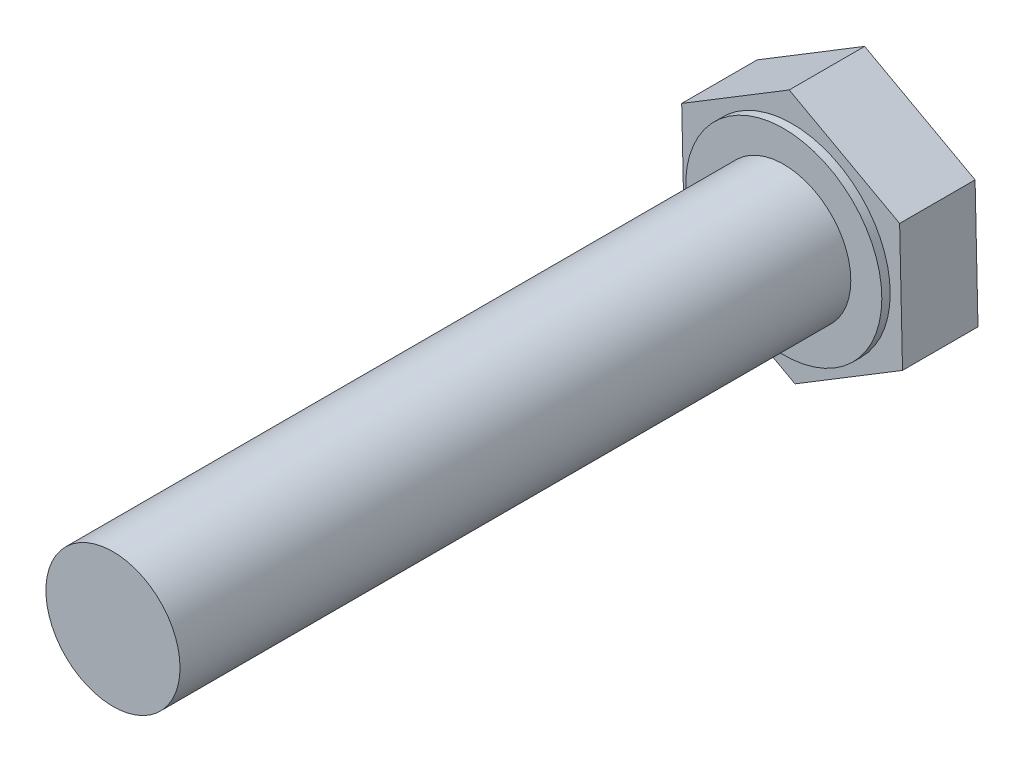
ISO-10303-21;
HEADER;
FILE_DESCRIPTION(('STEP AP214'),'2;1');
FILE_NAME('part.step','',(''),(''),'','','');
FILE_SCHEMA(('AUTOMOTIVE_DESIGN { 1 0 10303 214 1 1 1 1 }'));
ENDSEC;
DATA;
#1=APPLICATION_CONTEXT('core data for automotive mechanical design processes');
#2=APPLICATION_PROTOCOL_DEFINITION('international standard','automotive_design',2000,#1);
#3=PRODUCT_CONTEXT('',#1,'mechanical');
#4=PRODUCT('Part','Part','',(#3));
#5=PRODUCT_RELATED_PRODUCT_CATEGORY('part','',(#4));
#6=PRODUCT_DEFINITION_FORMATION('','',#4);
#7=PRODUCT_DEFINITION_CONTEXT('part definition',#1,'design');
#8=PRODUCT_DEFINITION('design','',#6,#7);
#9=PRODUCT_DEFINITION_SHAPE('','',#8);
#10=(LENGTH_UNIT() NAMED_UNIT(*) SI_UNIT(.MILLI.,.METRE.));
#11=(NAMED_UNIT(*) PLANE_ANGLE_UNIT() SI_UNIT($,.RADIAN.));
#12=(NAMED_UNIT(*) SI_UNIT($,.STERADIAN.) SOLID_ANGLE_UNIT());
#13=UNCERTAINTY_MEASURE_WITH_UNIT(LENGTH_MEASURE(1.E-05),#10,'distance_accuracy_value','');
#14=(GEOMETRIC_REPRESENTATION_CONTEXT(3) GLOBAL_UNCERTAINTY_ASSIGNED_CONTEXT((#13)) GLOBAL_UNIT_ASSIGNED_CONTEXT((#10,
#11,#12)) REPRESENTATION_CONTEXT('',''));
#15=CARTESIAN_POINT('',(0.,0.,0.));
#16=DIRECTION('',(0.,0.,1.));
#17=DIRECTION('',(1.,0.,0.));
#18=AXIS2_PLACEMENT_3D('',#15,#16,#17);
#19=CARTESIAN_POINT('',(-6.58498311375205,3.60157336797873,4.5));
#20=DIRECTION('',(0.999732976991626,0.0231078929255952,0.));
#21=DIRECTION('',(-0.0231078929255952,0.999732976991626,0.));
#22=AXIS2_PLACEMENT_3D('',#19,#20,#21);
#23=PLANE('',#22);
#24=DIRECTION('',(0.0231078929255952,-0.999732976991626,0.));
#25=VECTOR('',#24,1.);
#26=CARTESIAN_POINT('',(-6.58498311375205,3.60157336797873,0.));
#27=LINE('',#26,#25);
#28=CARTESIAN_POINT('',(-6.58498311375205,3.60157336797873,0.));
#29=VERTEX_POINT('',#28);
#30=CARTESIAN_POINT('',(-6.41154558713909,-3.90197597601147,0.));
#31=VERTEX_POINT('',#30);
#32=EDGE_CURVE('E122',#29,#31,#27,.T.);
#33=ORIENTED_EDGE('',*,*,#32,.T.);
#34=DIRECTION('',(0.,0.,-1.));
#35=VECTOR('',#34,1.);
#36=CARTESIAN_POINT('',(-6.41154558713909,-3.90197597601147,4.5));
#37=LINE('',#36,#35);
#38=CARTESIAN_POINT('',(-6.41154558713909,-3.90197597601147,4.5));
#39=VERTEX_POINT('',#38);
#40=EDGE_CURVE('E38',#39,#31,#37,.T.);
#41=ORIENTED_EDGE('',*,*,#40,.F.);
#42=DIRECTION('',(0.0231078929255952,-0.999732976991626,0.));
#43=VECTOR('',#42,1.);
#44=CARTESIAN_POINT('',(-6.58498311375205,3.60157336797873,4.5));
#45=LINE('',#44,#43);
#46=CARTESIAN_POINT('',(-6.58498311375205,3.60157336797873,4.5));
#47=VERTEX_POINT('',#46);
#48=EDGE_CURVE('E133',#47,#39,#45,.T.);
#49=ORIENTED_EDGE('',*,*,#48,.F.);
#50=DIRECTION('',(0.,0.,-1.));
#51=VECTOR('',#50,1.);
#52=CARTESIAN_POINT('',(-6.58498311375205,3.60157336797873,4.5));
#53=LINE('',#52,#51);
#54=EDGE_CURVE('E118',#47,#29,#53,.T.);
#55=ORIENTED_EDGE('',*,*,#54,.T.);
#56=EDGE_LOOP('',(#33,#41,#49,#55));
#57=FACE_BOUND('',#56,.T.);
#58=ADVANCED_FACE('F35',(#57),#23,.F.);
#59=CARTESIAN_POINT('',(-6.41154558713909,-3.90197597601147,4.5));
#60=DIRECTION('',(0.479854466194317,0.87734810153859,0.));
#61=DIRECTION('',(-0.87734810153859,0.479854466194317,0.));
#62=AXIS2_PLACEMENT_3D('',#59,#60,#61);
#63=PLANE('',#62);
#64=DIRECTION('',(0.87734810153859,-0.479854466194317,0.));
#65=VECTOR('',#64,1.);
#66=CARTESIAN_POINT('',(-6.41154558713909,-3.90197597601147,0.));
#67=LINE('',#66,#65);
#68=CARTESIAN_POINT('',(0.173437526612967,-7.5035493439902,0.));
#69=VERTEX_POINT('',#68);
#70=EDGE_CURVE('E125',#31,#69,#67,.T.);
#71=ORIENTED_EDGE('',*,*,#70,.T.);
#72=DIRECTION('',(0.,0.,-1.));
#73=VECTOR('',#72,1.);
#74=CARTESIAN_POINT('',(0.173437526612967,-7.5035493439902,4.5));
#75=LINE('',#74,#73);
#76=CARTESIAN_POINT('',(0.173437526612967,-7.5035493439902,4.5));
#77=VERTEX_POINT('',#76);
#78=EDGE_CURVE('E136',#77,#69,#75,.T.);
#79=ORIENTED_EDGE('',*,*,#78,.F.);
#80=DIRECTION('',(0.87734810153859,-0.479854466194317,0.));
#81=VECTOR('',#80,1.);
#82=CARTESIAN_POINT('',(-6.41154558713909,-3.90197597601147,4.5));
#83=LINE('',#82,#81);
#84=EDGE_CURVE('E91',#39,#77,#83,.T.);
#85=ORIENTED_EDGE('',*,*,#84,.F.);
#86=ORIENTED_EDGE('',*,*,#40,.T.);
#87=EDGE_LOOP('',(#71,#79,#85,#86));
#88=FACE_BOUND('',#87,.T.);
#89=ADVANCED_FACE('F149',(#88),#63,.F.);
#90=CARTESIAN_POINT('',(0.173437526612967,-7.5035493439902,4.5));
#91=DIRECTION('',(-0.51987851079731,0.854240208612994,0.));
#92=DIRECTION('',(-0.854240208612994,-0.51987851079731,0.));
#93=AXIS2_PLACEMENT_3D('',#90,#91,#92);
#94=PLANE('',#93);
#95=DIRECTION('',(0.854240208612994,0.51987851079731,0.));
#96=VECTOR('',#95,1.);
#97=CARTESIAN_POINT('',(0.173437526612967,-7.5035493439902,0.));
#98=LINE('',#97,#96);
#99=CARTESIAN_POINT('',(6.58498311375205,-3.60157336797873,0.));
#100=VERTEX_POINT('',#99);
#101=EDGE_CURVE('E128',#69,#100,#98,.T.);
#102=ORIENTED_EDGE('',*,*,#101,.T.);
#103=DIRECTION('',(0.,0.,-1.));
#104=VECTOR('',#103,1.);
#105=CARTESIAN_POINT('',(6.58498311375205,-3.60157336797873,4.5));
#106=LINE('',#105,#104);
#107=CARTESIAN_POINT('',(6.58498311375205,-3.60157336797873,4.5));
#108=VERTEX_POINT('',#107);
#109=EDGE_CURVE('E113',#108,#100,#106,.T.);
#110=ORIENTED_EDGE('',*,*,#109,.F.);
#111=DIRECTION('',(0.854240208612994,0.51987851079731,0.));
#112=VECTOR('',#111,1.);
#113=CARTESIAN_POINT('',(0.173437526612967,-7.5035493439902,4.5));
#114=LINE('',#113,#112);
#115=EDGE_CURVE('E104',#77,#108,#114,.T.);
#116=ORIENTED_EDGE('',*,*,#115,.F.);
#117=ORIENTED_EDGE('',*,*,#78,.T.);
#118=EDGE_LOOP('',(#102,#110,#116,#117));
#119=FACE_BOUND('',#118,.T.);
#120=ADVANCED_FACE('F150',(#119),#94,.F.);
#121=CARTESIAN_POINT('',(6.58498311375205,-3.60157336797873,4.5));
#122=DIRECTION('',(-0.999732976991626,-0.0231078929255954,0.));
#123=DIRECTION('',(0.0231078929255954,-0.999732976991626,0.));
#124=AXIS2_PLACEMENT_3D('',#121,#122,#123);
#125=PLANE('',#124);
#126=DIRECTION('',(-0.0231078929255954,0.999732976991626,0.));
#127=VECTOR('',#126,1.);
#128=CARTESIAN_POINT('',(6.58498311375205,-3.60157336797873,0.));
#129=LINE('',#128,#127);
#130=CARTESIAN_POINT('',(6.41154558713909,3.90197597601147,0.));
#131=VERTEX_POINT('',#130);
#132=EDGE_CURVE('E112',#100,#131,#129,.T.);
#133=ORIENTED_EDGE('',*,*,#132,.T.);
#134=DIRECTION('',(0.,0.,-1.));
#135=VECTOR('',#134,1.);
#136=CARTESIAN_POINT('',(6.41154558713909,3.90197597601147,4.5));
#137=LINE('',#136,#135);
#138=CARTESIAN_POINT('',(6.41154558713909,3.90197597601147,4.5));
#139=VERTEX_POINT('',#138);
#140=EDGE_CURVE('E109',#139,#131,#137,.T.);
#141=ORIENTED_EDGE('',*,*,#140,.F.);
#142=DIRECTION('',(-0.0231078929255954,0.999732976991626,0.));
#143=VECTOR('',#142,1.);
#144=CARTESIAN_POINT('',(6.58498311375205,-3.60157336797873,4.5));
#145=LINE('',#144,#143);
#146=EDGE_CURVE('E98',#108,#139,#145,.T.);
#147=ORIENTED_EDGE('',*,*,#146,.F.);
#148=ORIENTED_EDGE('',*,*,#109,.T.);
#149=EDGE_LOOP('',(#133,#141,#147,#148));
#150=FACE_BOUND('',#149,.T.);
#151=ADVANCED_FACE('F110',(#150),#125,.F.);
#152=CARTESIAN_POINT('',(6.41154558713909,3.90197597601147,4.5));
#153=DIRECTION('',(-0.479854466194317,-0.87734810153859,0.));
#154=DIRECTION('',(0.87734810153859,-0.479854466194317,0.));
#155=AXIS2_PLACEMENT_3D('',#152,#153,#154);
#156=PLANE('',#155);
#157=DIRECTION('',(-0.87734810153859,0.479854466194317,0.));
#158=VECTOR('',#157,1.);
#159=CARTESIAN_POINT('',(6.41154558713909,3.90197597601147,0.));
#160=LINE('',#159,#158);
#161=CARTESIAN_POINT('',(-0.173437526612968,7.5035493439902,0.));
#162=VERTEX_POINT('',#161);
#163=EDGE_CURVE('E76',#131,#162,#160,.T.);
#164=ORIENTED_EDGE('',*,*,#163,.T.);
#165=DIRECTION('',(0.,0.,-1.));
#166=VECTOR('',#165,1.);
#167=CARTESIAN_POINT('',(-0.173437526612968,7.5035493439902,4.5));
#168=LINE('',#167,#166);
#169=CARTESIAN_POINT('',(-0.173437526612968,7.5035493439902,4.5));
#170=VERTEX_POINT('',#169);
#171=EDGE_CURVE('E114',#170,#162,#168,.T.);
#172=ORIENTED_EDGE('',*,*,#171,.F.);
#173=DIRECTION('',(-0.87734810153859,0.479854466194317,0.));
#174=VECTOR('',#173,1.);
#175=CARTESIAN_POINT('',(6.41154558713909,3.90197597601147,4.5));
#176=LINE('',#175,#174);
#177=EDGE_CURVE('E102',#139,#170,#176,.T.);
#178=ORIENTED_EDGE('',*,*,#177,.F.);
#179=ORIENTED_EDGE('',*,*,#140,.T.);
#180=EDGE_LOOP('',(#164,#172,#178,#179));
#181=FACE_BOUND('',#180,.T.);
#182=ADVANCED_FACE('F116',(#181),#156,.F.);
#183=CARTESIAN_POINT('',(-0.173437526612968,7.5035493439902,4.5));
#184=DIRECTION('',(0.51987851079731,-0.854240208612994,0.));
#185=DIRECTION('',(0.854240208612994,0.51987851079731,0.));
#186=AXIS2_PLACEMENT_3D('',#183,#184,#185);
#187=PLANE('',#186);
#188=DIRECTION('',(-0.854240208612994,-0.51987851079731,0.));
#189=VECTOR('',#188,1.);
#190=CARTESIAN_POINT('',(-0.173437526612968,7.5035493439902,0.));
#191=LINE('',#190,#189);
#192=EDGE_CURVE('E82',#162,#29,#191,.T.);
#193=ORIENTED_EDGE('',*,*,#192,.T.);
#194=ORIENTED_EDGE('',*,*,#54,.F.);
#195=DIRECTION('',(-0.854240208612994,-0.51987851079731,0.));
#196=VECTOR('',#195,1.);
#197=CARTESIAN_POINT('',(-0.173437526612968,7.5035493439902,4.5));
#198=LINE('',#197,#196);
#199=EDGE_CURVE('E53',#170,#47,#198,.T.);
#200=ORIENTED_EDGE('',*,*,#199,.F.);
#201=ORIENTED_EDGE('',*,*,#171,.T.);
#202=EDGE_LOOP('',(#193,#194,#200,#201));
#203=FACE_BOUND('',#202,.T.);
#204=ADVANCED_FACE('F155',(#203),#187,.F.);
#205=CARTESIAN_POINT('',(0.,0.,4.5));
#206=DIRECTION('',(0.,0.,1.));
#207=DIRECTION('',(1.,0.,0.));
#208=AXIS2_PLACEMENT_3D('',#205,#206,#207);
#209=PLANE('',#208);
#210=CARTESIAN_POINT('',(0.,0.,4.5));
#211=DIRECTION('',(0.,0.,1.));
#212=DIRECTION('',(1.,0.,0.));
#213=AXIS2_PLACEMENT_3D('',#210,#211,#212);
#214=CIRCLE('',#213,5.85);
#215=CARTESIAN_POINT('',(5.85,0.,4.5));
#216=VERTEX_POINT('',#215);
#217=EDGE_CURVE('E44',#216,#216,#214,.T.);
#218=ORIENTED_EDGE('',*,*,#217,.F.);
#219=EDGE_LOOP('',(#218));
#220=FACE_BOUND('',#219,.T.);
#221=ORIENTED_EDGE('',*,*,#48,.T.);
#222=ORIENTED_EDGE('',*,*,#84,.T.);
#223=ORIENTED_EDGE('',*,*,#115,.T.);
#224=ORIENTED_EDGE('',*,*,#146,.T.);
#225=ORIENTED_EDGE('',*,*,#177,.T.);
#226=ORIENTED_EDGE('',*,*,#199,.T.);
#227=EDGE_LOOP('',(#221,#222,#223,#224,#225,#226));
#228=FACE_BOUND('',#227,.T.);
#229=ADVANCED_FACE('F100',(#220,#228),#209,.T.);
#230=CARTESIAN_POINT('',(0.,0.,0.));
#231=DIRECTION('',(0.,0.,1.));
#232=DIRECTION('',(1.,0.,0.));
#233=AXIS2_PLACEMENT_3D('',#230,#231,#232);
#234=PLANE('',#233);
#235=ORIENTED_EDGE('',*,*,#32,.F.);
#236=ORIENTED_EDGE('',*,*,#192,.F.);
#237=ORIENTED_EDGE('',*,*,#163,.F.);
#238=ORIENTED_EDGE('',*,*,#132,.F.);
#239=ORIENTED_EDGE('',*,*,#101,.F.);
#240=ORIENTED_EDGE('',*,*,#70,.F.);
#241=EDGE_LOOP('',(#235,#236,#237,#238,#239,#240));
#242=FACE_BOUND('',#241,.T.);
#243=ADVANCED_FACE('F153',(#242),#234,.F.);
#244=CARTESIAN_POINT('',(0.,0.,5.));
#245=DIRECTION('',(0.,0.,-1.));
#246=DIRECTION('',(-1.,0.,0.));
#247=AXIS2_PLACEMENT_3D('',#244,#245,#246);
#248=CYLINDRICAL_SURFACE('',#247,5.85);
#249=CARTESIAN_POINT('',(0.,0.,5.));
#250=DIRECTION('',(0.,0.,1.));
#251=DIRECTION('',(1.,0.,0.));
#252=AXIS2_PLACEMENT_3D('',#249,#250,#251);
#253=CIRCLE('',#252,5.85);
#254=CARTESIAN_POINT('',(5.85,0.,5.));
#255=VERTEX_POINT('',#254);
#256=EDGE_CURVE('E126',#255,#255,#253,.T.);
#257=ORIENTED_EDGE('',*,*,#256,.F.);
#258=EDGE_LOOP('',(#257));
#259=FACE_BOUND('',#258,.T.);
#260=ORIENTED_EDGE('',*,*,#217,.T.);
#261=EDGE_LOOP('',(#260));
#262=FACE_BOUND('',#261,.T.);
#263=ADVANCED_FACE('F198',(#259,#262),#248,.T.);
#264=CARTESIAN_POINT('',(0.,0.,5.));
#265=DIRECTION('',(0.,0.,1.));
#266=DIRECTION('',(1.,0.,0.));
#267=AXIS2_PLACEMENT_3D('',#264,#265,#266);
#268=PLANE('',#267);
#269=CARTESIAN_POINT('',(0.,0.,5.));
#270=DIRECTION('',(0.,0.,1.));
#271=DIRECTION('',(1.,0.,0.));
#272=AXIS2_PLACEMENT_3D('',#269,#270,#271);
#273=CIRCLE('',#272,4.);
#274=CARTESIAN_POINT('',(4.,0.,5.));
#275=VERTEX_POINT('',#274);
#276=EDGE_CURVE('E11',#275,#275,#273,.T.);
#277=ORIENTED_EDGE('',*,*,#276,.F.);
#278=EDGE_LOOP('',(#277));
#279=FACE_BOUND('',#278,.T.);
#280=ORIENTED_EDGE('',*,*,#256,.T.);
#281=EDGE_LOOP('',(#280));
#282=FACE_BOUND('',#281,.T.);
#283=ADVANCED_FACE('F211',(#279,#282),#268,.T.);
#284=CARTESIAN_POINT('',(0.,0.,45.));
#285=DIRECTION('',(0.,0.,-1.));
#286=DIRECTION('',(-1.,0.,0.));
#287=AXIS2_PLACEMENT_3D('',#284,#285,#286);
#288=CYLINDRICAL_SURFACE('',#287,4.);
#289=CARTESIAN_POINT('',(0.,0.,45.));
#290=DIRECTION('',(0.,0.,1.));
#291=DIRECTION('',(1.,0.,0.));
#292=AXIS2_PLACEMENT_3D('',#289,#290,#291);
#293=CIRCLE('',#292,4.);
#294=CARTESIAN_POINT('',(4.,0.,45.));
#295=VERTEX_POINT('',#294);
#296=EDGE_CURVE('E249',#295,#295,#293,.T.);
#297=ORIENTED_EDGE('',*,*,#296,.F.);
#298=EDGE_LOOP('',(#297));
#299=FACE_BOUND('',#298,.T.);
#300=ORIENTED_EDGE('',*,*,#276,.T.);
#301=EDGE_LOOP('',(#300));
#302=FACE_BOUND('',#301,.T.);
#303=ADVANCED_FACE('F221',(#299,#302),#288,.T.);
#304=CARTESIAN_POINT('',(0.,0.,45.));
#305=DIRECTION('',(0.,0.,1.));
#306=DIRECTION('',(1.,0.,0.));
#307=AXIS2_PLACEMENT_3D('',#304,#305,#306);
#308=PLANE('',#307);
#309=ORIENTED_EDGE('',*,*,#296,.T.);
#310=EDGE_LOOP('',(#309));
#311=FACE_BOUND('',#310,.T.);
#312=ADVANCED_FACE('F232',(#311),#308,.T.);
#313=CLOSED_SHELL('',(#58,#89,#120,#151,#182,#204,#229,#243,#263,#283,#303,#312));
#314=MANIFOLD_SOLID_BREP('B2',#313);
#315=ADVANCED_BREP_SHAPE_REPRESENTATION('',(#18,#314),#14);
#316=SHAPE_DEFINITION_REPRESENTATION(#9,#315);
ENDSEC;
END-ISO-10303-21;
